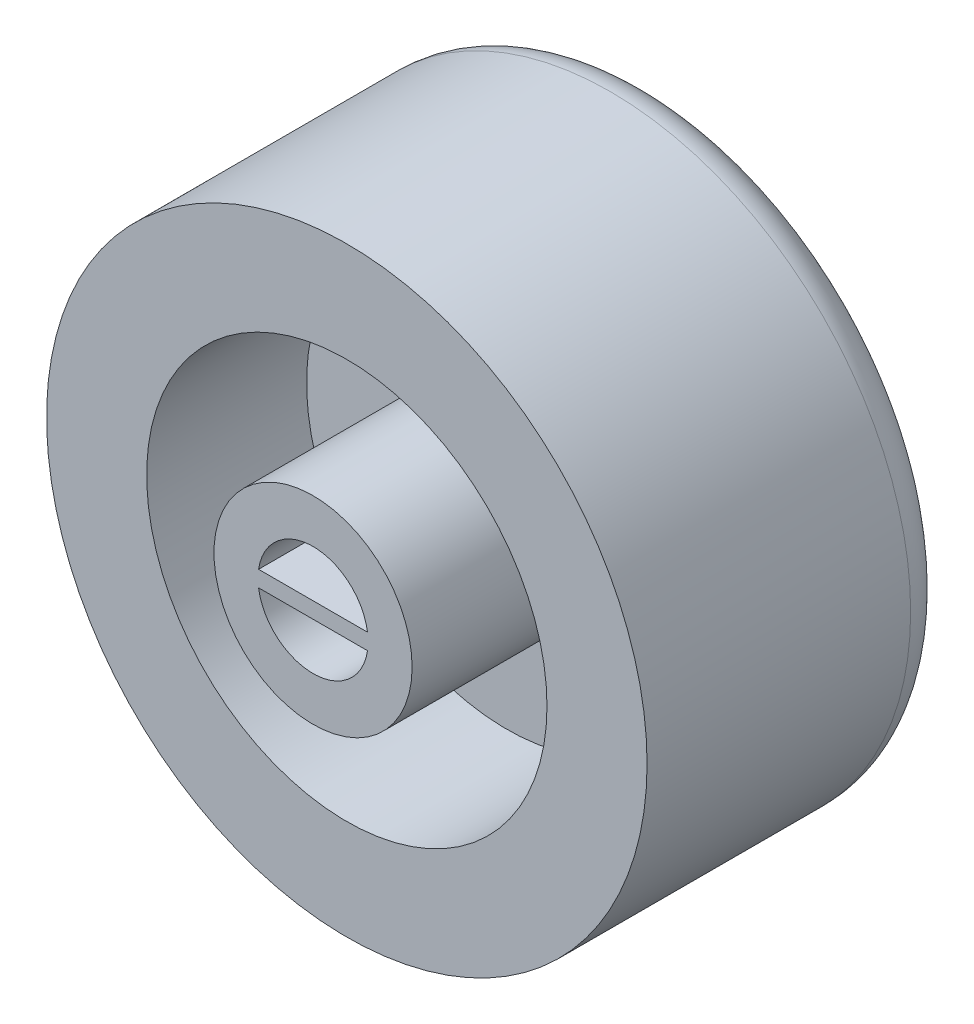
ISO-10303-21;
HEADER;
FILE_DESCRIPTION(('STEP AP214'),'2;1');
FILE_NAME('part.step','',(''),(''),'','','');
FILE_SCHEMA(('AUTOMOTIVE_DESIGN { 1 0 10303 214 1 1 1 1 }'));
ENDSEC;
DATA;
#1=APPLICATION_CONTEXT('core data for automotive mechanical design processes');
#2=APPLICATION_PROTOCOL_DEFINITION('international standard','automotive_design',2000,#1);
#3=PRODUCT_CONTEXT('',#1,'mechanical');
#4=PRODUCT('Part','Part','',(#3));
#5=PRODUCT_RELATED_PRODUCT_CATEGORY('part','',(#4));
#6=PRODUCT_DEFINITION_FORMATION('','',#4);
#7=PRODUCT_DEFINITION_CONTEXT('part definition',#1,'design');
#8=PRODUCT_DEFINITION('design','',#6,#7);
#9=PRODUCT_DEFINITION_SHAPE('','',#8);
#10=(LENGTH_UNIT() NAMED_UNIT(*) SI_UNIT(.MILLI.,.METRE.));
#11=(NAMED_UNIT(*) PLANE_ANGLE_UNIT() SI_UNIT($,.RADIAN.));
#12=(NAMED_UNIT(*) SI_UNIT($,.STERADIAN.) SOLID_ANGLE_UNIT());
#13=UNCERTAINTY_MEASURE_WITH_UNIT(LENGTH_MEASURE(1.E-05),#10,'distance_accuracy_value','');
#14=(GEOMETRIC_REPRESENTATION_CONTEXT(3) GLOBAL_UNCERTAINTY_ASSIGNED_CONTEXT((#13)) GLOBAL_UNIT_ASSIGNED_CONTEXT((#10,
#11,#12)) REPRESENTATION_CONTEXT('',''));
#15=CARTESIAN_POINT('',(0.,0.,0.));
#16=DIRECTION('',(0.,0.,1.));
#17=DIRECTION('',(1.,0.,0.));
#18=AXIS2_PLACEMENT_3D('',#15,#16,#17);
#19=CARTESIAN_POINT('',(0.,0.,-53.6021146387843));
#20=DIRECTION('',(0.,0.,1.));
#21=DIRECTION('',(1.,0.,0.));
#22=AXIS2_PLACEMENT_3D('',#19,#20,#21);
#23=CYLINDRICAL_SURFACE('',#22,2.75);
#24=CARTESIAN_POINT('',(0.,0.,-53.6021146387843));
#25=DIRECTION('',(0.,0.,1.));
#26=DIRECTION('',(1.,0.,0.));
#27=AXIS2_PLACEMENT_3D('',#24,#25,#26);
#28=CIRCLE('',#27,2.75);
#29=CARTESIAN_POINT('',(-2.72075357208256,-0.4,-53.6021146387843));
#30=VERTEX_POINT('',#29);
#31=CARTESIAN_POINT('',(2.72075357208256,-0.4,-53.6021146387843));
#32=VERTEX_POINT('',#31);
#33=EDGE_CURVE('E108',#30,#32,#28,.T.);
#34=ORIENTED_EDGE('',*,*,#33,.F.);
#35=DIRECTION('',(0.,0.,1.));
#36=VECTOR('',#35,1.);
#37=CARTESIAN_POINT('',(-2.72075357208256,-0.4,-53.6021146387843));
#38=LINE('',#37,#36);
#39=CARTESIAN_POINT('',(-2.72075357208256,-0.4,-40.6021146387843));
#40=VERTEX_POINT('',#39);
#41=EDGE_CURVE('E153',#30,#40,#38,.T.);
#42=ORIENTED_EDGE('',*,*,#41,.T.);
#43=CARTESIAN_POINT('',(0.,0.,-40.6021146387843));
#44=DIRECTION('',(0.,0.,1.));
#45=DIRECTION('',(1.,0.,0.));
#46=AXIS2_PLACEMENT_3D('',#43,#44,#45);
#47=CIRCLE('',#46,2.75);
#48=CARTESIAN_POINT('',(2.72075357208256,-0.4,-40.6021146387843));
#49=VERTEX_POINT('',#48);
#50=EDGE_CURVE('E107',#40,#49,#47,.T.);
#51=ORIENTED_EDGE('',*,*,#50,.T.);
#52=DIRECTION('',(0.,0.,1.));
#53=VECTOR('',#52,1.);
#54=CARTESIAN_POINT('',(2.72075357208256,-0.4,-53.6021146387843));
#55=LINE('',#54,#53);
#56=EDGE_CURVE('E156',#49,#32,#55,.F.);
#57=ORIENTED_EDGE('',*,*,#56,.T.);
#58=EDGE_LOOP('',(#34,#42,#51,#57));
#59=FACE_BOUND('',#58,.T.);
#60=ADVANCED_FACE('F52',(#59),#23,.F.);
#61=CARTESIAN_POINT('',(2.72075357208256,0.4,-53.6021146387843));
#62=VERTEX_POINT('',#61);
#63=CARTESIAN_POINT('',(-2.72075357208256,0.4,-53.6021146387843));
#64=VERTEX_POINT('',#63);
#65=EDGE_CURVE('E101',#62,#64,#28,.T.);
#66=ORIENTED_EDGE('',*,*,#65,.F.);
#67=DIRECTION('',(0.,0.,1.));
#68=VECTOR('',#67,1.);
#69=CARTESIAN_POINT('',(2.72075357208256,0.4,-53.6021146387843));
#70=LINE('',#69,#68);
#71=CARTESIAN_POINT('',(2.72075357208256,0.4,-40.6021146387843));
#72=VERTEX_POINT('',#71);
#73=EDGE_CURVE('E67',#62,#72,#70,.T.);
#74=ORIENTED_EDGE('',*,*,#73,.T.);
#75=CARTESIAN_POINT('',(-2.72075357208256,0.4,-40.6021146387843));
#76=VERTEX_POINT('',#75);
#77=EDGE_CURVE('E103',#72,#76,#47,.T.);
#78=ORIENTED_EDGE('',*,*,#77,.T.);
#79=DIRECTION('',(0.,0.,1.));
#80=VECTOR('',#79,1.);
#81=CARTESIAN_POINT('',(-2.72075357208256,0.4,-53.6021146387843));
#82=LINE('',#81,#80);
#83=EDGE_CURVE('E92',#76,#64,#82,.F.);
#84=ORIENTED_EDGE('',*,*,#83,.T.);
#85=EDGE_LOOP('',(#66,#74,#78,#84));
#86=FACE_BOUND('',#85,.T.);
#87=ADVANCED_FACE('F100',(#86),#23,.F.);
#88=CARTESIAN_POINT('',(2.75,0.,-53.6021146387843));
#89=DIRECTION('',(0.,0.,1.));
#90=DIRECTION('',(1.,0.,0.));
#91=AXIS2_PLACEMENT_3D('',#88,#89,#90);
#92=PLANE('',#91);
#93=ORIENTED_EDGE('',*,*,#33,.T.);
#94=DIRECTION('',(-1.,0.,0.));
#95=VECTOR('',#94,1.);
#96=CARTESIAN_POINT('',(2.75,-0.4,-53.6021146387843));
#97=LINE('',#96,#95);
#98=EDGE_CURVE('E13',#32,#30,#97,.T.);
#99=ORIENTED_EDGE('',*,*,#98,.T.);
#100=EDGE_LOOP('',(#93,#99));
#101=FACE_BOUND('',#100,.T.);
#102=ADVANCED_FACE('F171',(#101),#92,.T.);
#103=ORIENTED_EDGE('',*,*,#65,.T.);
#104=DIRECTION('',(1.,0.,0.));
#105=VECTOR('',#104,1.);
#106=CARTESIAN_POINT('',(2.75,0.4,-53.6021146387843));
#107=LINE('',#106,#105);
#108=EDGE_CURVE('E60',#64,#62,#107,.T.);
#109=ORIENTED_EDGE('',*,*,#108,.T.);
#110=EDGE_LOOP('',(#103,#109));
#111=FACE_BOUND('',#110,.T.);
#112=ADVANCED_FACE('F106',(#111),#92,.T.);
#113=CARTESIAN_POINT('',(4.95,0.,-40.6021146387843));
#114=DIRECTION('',(0.,0.,1.));
#115=DIRECTION('',(1.,0.,0.));
#116=AXIS2_PLACEMENT_3D('',#113,#114,#115);
#117=PLANE('',#116);
#118=DIRECTION('',(1.,0.,0.));
#119=VECTOR('',#118,1.);
#120=CARTESIAN_POINT('',(-3.00117861847982,-0.4,-40.6021146387843));
#121=LINE('',#120,#119);
#122=EDGE_CURVE('E161',#40,#49,#121,.T.);
#123=ORIENTED_EDGE('',*,*,#122,.T.);
#124=ORIENTED_EDGE('',*,*,#50,.F.);
#125=EDGE_LOOP('',(#123,#124));
#126=FACE_BOUND('',#125,.T.);
#127=DIRECTION('',(-1.,0.,0.));
#128=VECTOR('',#127,1.);
#129=CARTESIAN_POINT('',(-3.00117861847982,0.4,-40.6021146387843));
#130=LINE('',#129,#128);
#131=EDGE_CURVE('E104',#72,#76,#130,.T.);
#132=ORIENTED_EDGE('',*,*,#131,.T.);
#133=ORIENTED_EDGE('',*,*,#77,.F.);
#134=EDGE_LOOP('',(#132,#133));
#135=FACE_BOUND('',#134,.T.);
#136=CARTESIAN_POINT('',(0.,0.,-40.6021146387843));
#137=DIRECTION('',(0.,0.,1.));
#138=DIRECTION('',(1.,0.,0.));
#139=AXIS2_PLACEMENT_3D('',#136,#137,#138);
#140=CIRCLE('',#139,4.95);
#141=CARTESIAN_POINT('',(4.95,0.,-40.6021146387843));
#142=VERTEX_POINT('',#141);
#143=EDGE_CURVE('E150',#142,#142,#140,.T.);
#144=ORIENTED_EDGE('',*,*,#143,.T.);
#145=EDGE_LOOP('',(#144));
#146=FACE_BOUND('',#145,.T.);
#147=ADVANCED_FACE('F165',(#126,#135,#146),#117,.T.);
#148=CARTESIAN_POINT('',(0.,0.,-57.2897846858954));
#149=DIRECTION('',(0.,0.,1.));
#150=DIRECTION('',(1.,0.,0.));
#151=AXIS2_PLACEMENT_3D('',#148,#149,#150);
#152=CONICAL_SURFACE('',#151,15.,1.48352986419518);
#153=CARTESIAN_POINT('',(0.,0.,-57.4495117340441));
#154=DIRECTION('',(0.,0.,-1.));
#155=DIRECTION('',(-1.,0.,0.));
#156=AXIS2_PLACEMENT_3D('',#153,#154,#155);
#157=CIRCLE('',#156,13.1743114854953);
#158=CARTESIAN_POINT('',(-13.1743114854953,0.,-57.4495117340441));
#159=VERTEX_POINT('',#158);
#160=EDGE_CURVE('E97',#159,#159,#157,.T.);
#161=ORIENTED_EDGE('',*,*,#160,.T.);
#162=EDGE_LOOP('',(#161));
#163=FACE_BOUND('',#162,.T.);
#164=CARTESIAN_POINT('',(0.,0.,-58.6021146387843));
#165=VERTEX_POINT('',#164);
#166=VERTEX_LOOP('',#165);
#167=FACE_BOUND('',#166,.T.);
#168=ADVANCED_FACE('F123',(#163,#167),#152,.T.);
#169=CARTESIAN_POINT('',(0.,0.,-53.6021146387843));
#170=DIRECTION('',(0.,0.,1.));
#171=DIRECTION('',(1.,0.,0.));
#172=AXIS2_PLACEMENT_3D('',#169,#170,#171);
#173=CYLINDRICAL_SURFACE('',#172,15.);
#174=CARTESIAN_POINT('',(0.,0.,-55.4571223378606));
#175=DIRECTION('',(0.,0.,-1.));
#176=DIRECTION('',(-1.,0.,0.));
#177=AXIS2_PLACEMENT_3D('',#174,#175,#176);
#178=CIRCLE('',#177,15.);
#179=CARTESIAN_POINT('',(-15.,0.,-55.4571223378606));
#180=VERTEX_POINT('',#179);
#181=EDGE_CURVE('E117',#180,#180,#178,.F.);
#182=ORIENTED_EDGE('',*,*,#181,.T.);
#183=EDGE_LOOP('',(#182));
#184=FACE_BOUND('',#183,.T.);
#185=CARTESIAN_POINT('',(0.,0.,-42.2897846858954));
#186=DIRECTION('',(0.,0.,1.));
#187=DIRECTION('',(1.,0.,0.));
#188=AXIS2_PLACEMENT_3D('',#185,#186,#187);
#189=CIRCLE('',#188,15.);
#190=CARTESIAN_POINT('',(15.,0.,-42.2897846858954));
#191=VERTEX_POINT('',#190);
#192=EDGE_CURVE('E113',#191,#191,#189,.T.);
#193=ORIENTED_EDGE('',*,*,#192,.F.);
#194=EDGE_LOOP('',(#193));
#195=FACE_BOUND('',#194,.T.);
#196=ADVANCED_FACE('F131',(#184,#195),#173,.T.);
#197=CARTESIAN_POINT('',(15.,0.,-42.2897846858954));
#198=DIRECTION('',(0.,0.,1.));
#199=DIRECTION('',(1.,0.,0.));
#200=AXIS2_PLACEMENT_3D('',#197,#198,#199);
#201=PLANE('',#200);
#202=ORIENTED_EDGE('',*,*,#192,.T.);
#203=EDGE_LOOP('',(#202));
#204=FACE_BOUND('',#203,.T.);
#205=CARTESIAN_POINT('',(0.,0.,-42.2897846858954));
#206=DIRECTION('',(0.,0.,1.));
#207=DIRECTION('',(1.,0.,0.));
#208=AXIS2_PLACEMENT_3D('',#205,#206,#207);
#209=CIRCLE('',#208,10.);
#210=CARTESIAN_POINT('',(10.,0.,-42.2897846858954));
#211=VERTEX_POINT('',#210);
#212=EDGE_CURVE('E139',#211,#211,#209,.T.);
#213=ORIENTED_EDGE('',*,*,#212,.F.);
#214=EDGE_LOOP('',(#213));
#215=FACE_BOUND('',#214,.T.);
#216=ADVANCED_FACE('F134',(#204,#215),#201,.T.);
#217=CARTESIAN_POINT('',(0.,0.,-53.6021146387843));
#218=DIRECTION('',(0.,0.,1.));
#219=DIRECTION('',(1.,0.,0.));
#220=AXIS2_PLACEMENT_3D('',#217,#218,#219);
#221=CYLINDRICAL_SURFACE('',#220,10.);
#222=ORIENTED_EDGE('',*,*,#212,.T.);
#223=EDGE_LOOP('',(#222));
#224=FACE_BOUND('',#223,.T.);
#225=CARTESIAN_POINT('',(0.,0.,-50.2782222229873));
#226=DIRECTION('',(0.,0.,1.));
#227=DIRECTION('',(1.,0.,0.));
#228=AXIS2_PLACEMENT_3D('',#225,#226,#227);
#229=CIRCLE('',#228,10.);
#230=CARTESIAN_POINT('',(10.,0.,-50.2782222229873));
#231=VERTEX_POINT('',#230);
#232=EDGE_CURVE('E141',#231,#231,#229,.T.);
#233=ORIENTED_EDGE('',*,*,#232,.F.);
#234=EDGE_LOOP('',(#233));
#235=FACE_BOUND('',#234,.T.);
#236=ADVANCED_FACE('F192',(#224,#235),#221,.F.);
#237=CARTESIAN_POINT('',(10.,0.,-50.2782222229873));
#238=DIRECTION('',(0.,0.,1.));
#239=DIRECTION('',(1.,0.,0.));
#240=AXIS2_PLACEMENT_3D('',#237,#238,#239);
#241=PLANE('',#240);
#242=ORIENTED_EDGE('',*,*,#232,.T.);
#243=EDGE_LOOP('',(#242));
#244=FACE_BOUND('',#243,.T.);
#245=CARTESIAN_POINT('',(0.,0.,-50.2782222229873));
#246=DIRECTION('',(0.,0.,1.));
#247=DIRECTION('',(1.,0.,0.));
#248=AXIS2_PLACEMENT_3D('',#245,#246,#247);
#249=CIRCLE('',#248,4.95);
#250=CARTESIAN_POINT('',(4.95,0.,-50.2782222229873));
#251=VERTEX_POINT('',#250);
#252=EDGE_CURVE('E145',#251,#251,#249,.T.);
#253=ORIENTED_EDGE('',*,*,#252,.F.);
#254=EDGE_LOOP('',(#253));
#255=FACE_BOUND('',#254,.T.);
#256=ADVANCED_FACE('F195',(#244,#255),#241,.T.);
#257=CARTESIAN_POINT('',(0.,0.,-53.6021146387843));
#258=DIRECTION('',(0.,0.,1.));
#259=DIRECTION('',(1.,0.,0.));
#260=AXIS2_PLACEMENT_3D('',#257,#258,#259);
#261=CYLINDRICAL_SURFACE('',#260,4.95);
#262=ORIENTED_EDGE('',*,*,#252,.T.);
#263=EDGE_LOOP('',(#262));
#264=FACE_BOUND('',#263,.T.);
#265=ORIENTED_EDGE('',*,*,#143,.F.);
#266=EDGE_LOOP('',(#265));
#267=FACE_BOUND('',#266,.T.);
#268=ADVANCED_FACE('F128',(#264,#267),#261,.T.);
#269=CARTESIAN_POINT('',(0.,0.,-55.4571223378606));
#270=DIRECTION('',(0.,0.,-1.));
#271=DIRECTION('',(-1.,0.,0.));
#272=AXIS2_PLACEMENT_3D('',#269,#270,#271);
#273=TOROIDAL_SURFACE('',#272,13.,2.);
#274=ORIENTED_EDGE('',*,*,#160,.F.);
#275=EDGE_LOOP('',(#274));
#276=FACE_BOUND('',#275,.T.);
#277=ORIENTED_EDGE('',*,*,#181,.F.);
#278=EDGE_LOOP('',(#277));
#279=FACE_BOUND('',#278,.T.);
#280=ADVANCED_FACE('F54',(#276,#279),#273,.T.);
#281=CARTESIAN_POINT('',(-3.00117861847982,-0.4,-40.6021146387843));
#282=DIRECTION('',(0.,1.,0.));
#283=DIRECTION('',(0.,0.,1.));
#284=AXIS2_PLACEMENT_3D('',#281,#282,#283);
#285=PLANE('',#284);
#286=ORIENTED_EDGE('',*,*,#41,.F.);
#287=ORIENTED_EDGE('',*,*,#98,.F.);
#288=ORIENTED_EDGE('',*,*,#56,.F.);
#289=ORIENTED_EDGE('',*,*,#122,.F.);
#290=EDGE_LOOP('',(#286,#287,#288,#289));
#291=FACE_BOUND('',#290,.T.);
#292=ADVANCED_FACE('F127',(#291),#285,.F.);
#293=CARTESIAN_POINT('',(-3.00117861847982,0.4,-40.6021146387843));
#294=DIRECTION('',(0.,-1.,0.));
#295=DIRECTION('',(0.,0.,-1.));
#296=AXIS2_PLACEMENT_3D('',#293,#294,#295);
#297=PLANE('',#296);
#298=ORIENTED_EDGE('',*,*,#73,.F.);
#299=ORIENTED_EDGE('',*,*,#108,.F.);
#300=ORIENTED_EDGE('',*,*,#83,.F.);
#301=ORIENTED_EDGE('',*,*,#131,.F.);
#302=EDGE_LOOP('',(#298,#299,#300,#301));
#303=FACE_BOUND('',#302,.T.);
#304=ADVANCED_FACE('F91',(#303),#297,.F.);
#305=CLOSED_SHELL('',(#60,#87,#102,#112,#147,#168,#196,#216,#236,#256,#268,#280,#292,#304));
#306=MANIFOLD_SOLID_BREP('B2',#305);
#307=ADVANCED_BREP_SHAPE_REPRESENTATION('',(#18,#306),#14);
#308=SHAPE_DEFINITION_REPRESENTATION(#9,#307);
ENDSEC;
END-ISO-10303-21;
